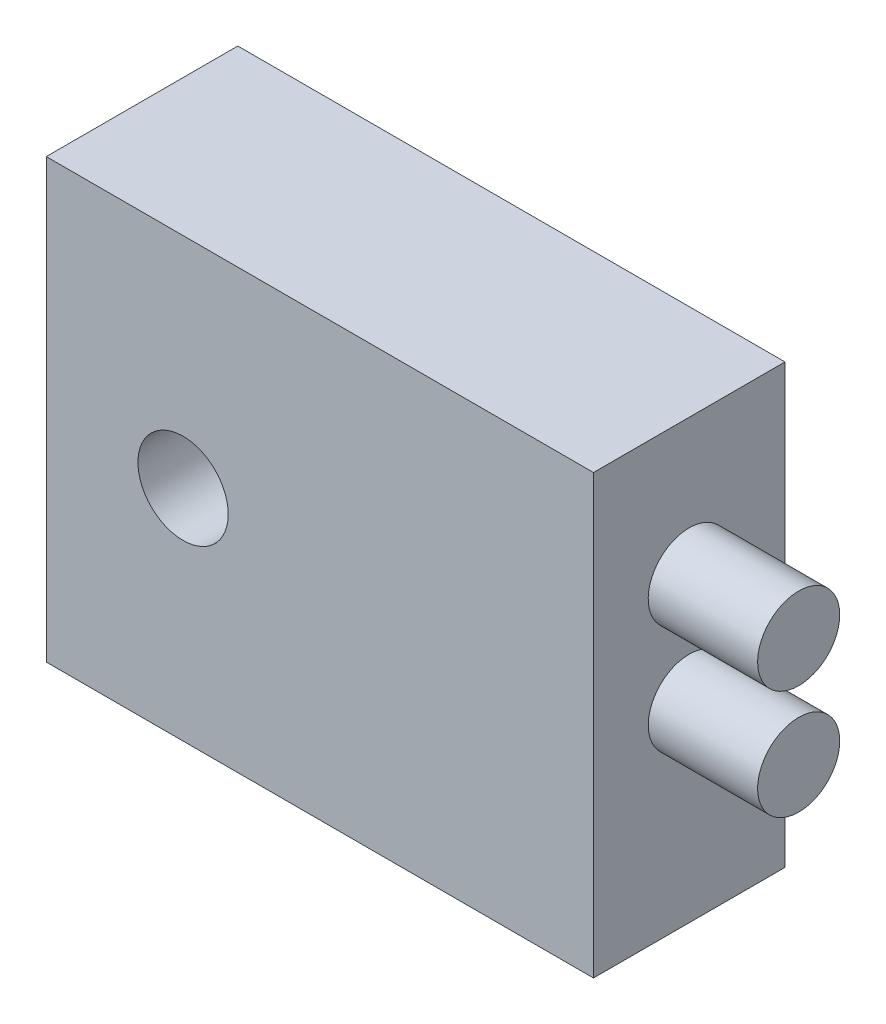
ISO-10303-21;
HEADER;
FILE_DESCRIPTION(('STEP AP214'),'2;1');
FILE_NAME('part.step','',(''),(''),'','','');
FILE_SCHEMA(('AUTOMOTIVE_DESIGN { 1 0 10303 214 1 1 1 1 }'));
ENDSEC;
DATA;
#1=APPLICATION_CONTEXT('core data for automotive mechanical design processes');
#2=APPLICATION_PROTOCOL_DEFINITION('international standard','automotive_design',2000,#1);
#3=PRODUCT_CONTEXT('',#1,'mechanical');
#4=PRODUCT('Part','Part','',(#3));
#5=PRODUCT_RELATED_PRODUCT_CATEGORY('part','',(#4));
#6=PRODUCT_DEFINITION_FORMATION('','',#4);
#7=PRODUCT_DEFINITION_CONTEXT('part definition',#1,'design');
#8=PRODUCT_DEFINITION('design','',#6,#7);
#9=PRODUCT_DEFINITION_SHAPE('','',#8);
#10=(LENGTH_UNIT() NAMED_UNIT(*) SI_UNIT(.MILLI.,.METRE.));
#11=(NAMED_UNIT(*) PLANE_ANGLE_UNIT() SI_UNIT($,.RADIAN.));
#12=(NAMED_UNIT(*) SI_UNIT($,.STERADIAN.) SOLID_ANGLE_UNIT());
#13=UNCERTAINTY_MEASURE_WITH_UNIT(LENGTH_MEASURE(1.E-05),#10,'distance_accuracy_value','');
#14=(GEOMETRIC_REPRESENTATION_CONTEXT(3) GLOBAL_UNCERTAINTY_ASSIGNED_CONTEXT((#13)) GLOBAL_UNIT_ASSIGNED_CONTEXT((#10,
#11,#12)) REPRESENTATION_CONTEXT('',''));
#15=CARTESIAN_POINT('',(0.,0.,0.));
#16=DIRECTION('',(0.,0.,1.));
#17=DIRECTION('',(1.,0.,0.));
#18=AXIS2_PLACEMENT_3D('',#15,#16,#17);
#19=CARTESIAN_POINT('',(0.,0.,7.));
#20=DIRECTION('',(0.,0.,-1.));
#21=DIRECTION('',(-1.,0.,0.));
#22=AXIS2_PLACEMENT_3D('',#19,#20,#21);
#23=PLANE('',#22);
#24=DIRECTION('',(0.,-1.,0.));
#25=VECTOR('',#24,1.);
#26=CARTESIAN_POINT('',(0.,0.,7.));
#27=LINE('',#26,#25);
#28=CARTESIAN_POINT('',(0.,16.,7.));
#29=VERTEX_POINT('',#28);
#30=CARTESIAN_POINT('',(0.,0.,7.));
#31=VERTEX_POINT('',#30);
#32=EDGE_CURVE('E90',#29,#31,#27,.T.);
#33=ORIENTED_EDGE('',*,*,#32,.T.);
#34=DIRECTION('',(1.,0.,0.));
#35=VECTOR('',#34,1.);
#36=CARTESIAN_POINT('',(0.,0.,7.));
#37=LINE('',#36,#35);
#38=CARTESIAN_POINT('',(20.,0.,7.));
#39=VERTEX_POINT('',#38);
#40=EDGE_CURVE('E85',#31,#39,#37,.T.);
#41=ORIENTED_EDGE('',*,*,#40,.T.);
#42=DIRECTION('',(0.,1.,0.));
#43=VECTOR('',#42,1.);
#44=CARTESIAN_POINT('',(20.,0.,7.));
#45=LINE('',#44,#43);
#46=CARTESIAN_POINT('',(20.,16.,7.));
#47=VERTEX_POINT('',#46);
#48=EDGE_CURVE('E88',#39,#47,#45,.T.);
#49=ORIENTED_EDGE('',*,*,#48,.T.);
#50=DIRECTION('',(-1.,0.,0.));
#51=VECTOR('',#50,1.);
#52=CARTESIAN_POINT('',(0.,16.,7.));
#53=LINE('',#52,#51);
#54=EDGE_CURVE('E54',#47,#29,#53,.T.);
#55=ORIENTED_EDGE('',*,*,#54,.T.);
#56=EDGE_LOOP('',(#33,#41,#49,#55));
#57=FACE_BOUND('',#56,.T.);
#58=CARTESIAN_POINT('',(5.,8.,7.));
#59=DIRECTION('',(0.,0.,1.));
#60=DIRECTION('',(1.,0.,0.));
#61=AXIS2_PLACEMENT_3D('',#58,#59,#60);
#62=CIRCLE('',#61,1.65);
#63=CARTESIAN_POINT('',(6.65,8.,7.));
#64=VERTEX_POINT('',#63);
#65=EDGE_CURVE('E113',#64,#64,#62,.T.);
#66=ORIENTED_EDGE('',*,*,#65,.F.);
#67=EDGE_LOOP('',(#66));
#68=FACE_BOUND('',#67,.T.);
#69=ADVANCED_FACE('F36',(#57,#68),#23,.F.);
#70=CARTESIAN_POINT('',(0.,0.,0.));
#71=DIRECTION('',(0.,0.,-1.));
#72=DIRECTION('',(-1.,0.,0.));
#73=AXIS2_PLACEMENT_3D('',#70,#71,#72);
#74=PLANE('',#73);
#75=DIRECTION('',(0.,-1.,0.));
#76=VECTOR('',#75,1.);
#77=CARTESIAN_POINT('',(0.,0.,0.));
#78=LINE('',#77,#76);
#79=CARTESIAN_POINT('',(0.,16.,0.));
#80=VERTEX_POINT('',#79);
#81=CARTESIAN_POINT('',(0.,0.,0.));
#82=VERTEX_POINT('',#81);
#83=EDGE_CURVE('E109',#80,#82,#78,.T.);
#84=ORIENTED_EDGE('',*,*,#83,.F.);
#85=DIRECTION('',(-1.,0.,0.));
#86=VECTOR('',#85,1.);
#87=CARTESIAN_POINT('',(0.,16.,0.));
#88=LINE('',#87,#86);
#89=CARTESIAN_POINT('',(20.,16.,0.));
#90=VERTEX_POINT('',#89);
#91=EDGE_CURVE('E77',#90,#80,#88,.T.);
#92=ORIENTED_EDGE('',*,*,#91,.F.);
#93=DIRECTION('',(0.,1.,0.));
#94=VECTOR('',#93,1.);
#95=CARTESIAN_POINT('',(20.,0.,0.));
#96=LINE('',#95,#94);
#97=CARTESIAN_POINT('',(20.,0.,0.));
#98=VERTEX_POINT('',#97);
#99=EDGE_CURVE('E71',#98,#90,#96,.T.);
#100=ORIENTED_EDGE('',*,*,#99,.F.);
#101=DIRECTION('',(1.,0.,0.));
#102=VECTOR('',#101,1.);
#103=CARTESIAN_POINT('',(0.,0.,0.));
#104=LINE('',#103,#102);
#105=EDGE_CURVE('E96',#82,#98,#104,.T.);
#106=ORIENTED_EDGE('',*,*,#105,.F.);
#107=EDGE_LOOP('',(#84,#92,#100,#106));
#108=FACE_BOUND('',#107,.T.);
#109=CARTESIAN_POINT('',(5.,8.,0.));
#110=DIRECTION('',(0.,0.,1.));
#111=DIRECTION('',(1.,0.,0.));
#112=AXIS2_PLACEMENT_3D('',#109,#110,#111);
#113=CIRCLE('',#112,1.65);
#114=CARTESIAN_POINT('',(6.65,8.,0.));
#115=VERTEX_POINT('',#114);
#116=EDGE_CURVE('E136',#115,#115,#113,.T.);
#117=ORIENTED_EDGE('',*,*,#116,.T.);
#118=EDGE_LOOP('',(#117));
#119=FACE_BOUND('',#118,.T.);
#120=ADVANCED_FACE('F171',(#108,#119),#74,.T.);
#121=CARTESIAN_POINT('',(0.,0.,7.));
#122=DIRECTION('',(1.,0.,0.));
#123=DIRECTION('',(0.,1.,0.));
#124=AXIS2_PLACEMENT_3D('',#121,#122,#123);
#125=PLANE('',#124);
#126=ORIENTED_EDGE('',*,*,#83,.T.);
#127=DIRECTION('',(0.,0.,-1.));
#128=VECTOR('',#127,1.);
#129=CARTESIAN_POINT('',(0.,0.,7.));
#130=LINE('',#129,#128);
#131=EDGE_CURVE('E98',#31,#82,#130,.T.);
#132=ORIENTED_EDGE('',*,*,#131,.F.);
#133=ORIENTED_EDGE('',*,*,#32,.F.);
#134=DIRECTION('',(0.,0.,-1.));
#135=VECTOR('',#134,1.);
#136=CARTESIAN_POINT('',(0.,16.,7.));
#137=LINE('',#136,#135);
#138=EDGE_CURVE('E105',#29,#80,#137,.T.);
#139=ORIENTED_EDGE('',*,*,#138,.T.);
#140=EDGE_LOOP('',(#126,#132,#133,#139));
#141=FACE_BOUND('',#140,.T.);
#142=ADVANCED_FACE('F38',(#141),#125,.F.);
#143=CARTESIAN_POINT('',(0.,0.,7.));
#144=DIRECTION('',(0.,1.,0.));
#145=DIRECTION('',(0.,0.,1.));
#146=AXIS2_PLACEMENT_3D('',#143,#144,#145);
#147=PLANE('',#146);
#148=ORIENTED_EDGE('',*,*,#105,.T.);
#149=DIRECTION('',(0.,0.,-1.));
#150=VECTOR('',#149,1.);
#151=CARTESIAN_POINT('',(20.,0.,7.));
#152=LINE('',#151,#150);
#153=EDGE_CURVE('E94',#39,#98,#152,.T.);
#154=ORIENTED_EDGE('',*,*,#153,.F.);
#155=ORIENTED_EDGE('',*,*,#40,.F.);
#156=ORIENTED_EDGE('',*,*,#131,.T.);
#157=EDGE_LOOP('',(#148,#154,#155,#156));
#158=FACE_BOUND('',#157,.T.);
#159=ADVANCED_FACE('F95',(#158),#147,.F.);
#160=CARTESIAN_POINT('',(20.,0.,7.));
#161=DIRECTION('',(-1.,0.,0.));
#162=DIRECTION('',(0.,-1.,0.));
#163=AXIS2_PLACEMENT_3D('',#160,#161,#162);
#164=PLANE('',#163);
#165=CARTESIAN_POINT('',(20.,11.,3.5));
#166=DIRECTION('',(-1.,0.,0.));
#167=DIRECTION('',(0.,-1.,0.));
#168=AXIS2_PLACEMENT_3D('',#165,#166,#167);
#169=CIRCLE('',#168,1.5);
#170=CARTESIAN_POINT('',(20.,9.5,3.5));
#171=VERTEX_POINT('',#170);
#172=EDGE_CURVE('E11',#171,#171,#169,.F.);
#173=ORIENTED_EDGE('',*,*,#172,.F.);
#174=EDGE_LOOP('',(#173));
#175=FACE_BOUND('',#174,.T.);
#176=CARTESIAN_POINT('',(20.,7.00000000000001,3.5));
#177=DIRECTION('',(1.,0.,0.));
#178=DIRECTION('',(0.,0.,-1.));
#179=AXIS2_PLACEMENT_3D('',#176,#177,#178);
#180=CIRCLE('',#179,1.5);
#181=CARTESIAN_POINT('',(20.,7.00000000000001,2.));
#182=VERTEX_POINT('',#181);
#183=EDGE_CURVE('E46',#182,#182,#180,.T.);
#184=ORIENTED_EDGE('',*,*,#183,.F.);
#185=EDGE_LOOP('',(#184));
#186=FACE_BOUND('',#185,.T.);
#187=ORIENTED_EDGE('',*,*,#99,.T.);
#188=DIRECTION('',(0.,0.,-1.));
#189=VECTOR('',#188,1.);
#190=CARTESIAN_POINT('',(20.,16.,7.));
#191=LINE('',#190,#189);
#192=EDGE_CURVE('E99',#47,#90,#191,.T.);
#193=ORIENTED_EDGE('',*,*,#192,.F.);
#194=ORIENTED_EDGE('',*,*,#48,.F.);
#195=ORIENTED_EDGE('',*,*,#153,.T.);
#196=EDGE_LOOP('',(#187,#193,#194,#195));
#197=FACE_BOUND('',#196,.T.);
#198=ADVANCED_FACE('F101',(#175,#186,#197),#164,.F.);
#199=CARTESIAN_POINT('',(0.,16.,7.));
#200=DIRECTION('',(0.,-1.,0.));
#201=DIRECTION('',(0.,0.,-1.));
#202=AXIS2_PLACEMENT_3D('',#199,#200,#201);
#203=PLANE('',#202);
#204=ORIENTED_EDGE('',*,*,#91,.T.);
#205=ORIENTED_EDGE('',*,*,#138,.F.);
#206=ORIENTED_EDGE('',*,*,#54,.F.);
#207=ORIENTED_EDGE('',*,*,#192,.T.);
#208=EDGE_LOOP('',(#204,#205,#206,#207));
#209=FACE_BOUND('',#208,.T.);
#210=ADVANCED_FACE('F162',(#209),#203,.F.);
#211=CARTESIAN_POINT('',(5.,8.,7.));
#212=DIRECTION('',(0.,0.,-1.));
#213=DIRECTION('',(-1.,0.,0.));
#214=AXIS2_PLACEMENT_3D('',#211,#212,#213);
#215=CYLINDRICAL_SURFACE('',#214,1.65);
#216=ORIENTED_EDGE('',*,*,#65,.T.);
#217=EDGE_LOOP('',(#216));
#218=FACE_BOUND('',#217,.T.);
#219=ORIENTED_EDGE('',*,*,#116,.F.);
#220=EDGE_LOOP('',(#219));
#221=FACE_BOUND('',#220,.T.);
#222=ADVANCED_FACE('F168',(#218,#221),#215,.F.);
#223=CARTESIAN_POINT('',(24.,7.00000000000001,3.5));
#224=DIRECTION('',(-1.,0.,0.));
#225=DIRECTION('',(0.,0.,1.));
#226=AXIS2_PLACEMENT_3D('',#223,#224,#225);
#227=CYLINDRICAL_SURFACE('',#226,1.5);
#228=CARTESIAN_POINT('',(24.,7.00000000000001,3.5));
#229=DIRECTION('',(1.,0.,0.));
#230=DIRECTION('',(0.,0.,-1.));
#231=AXIS2_PLACEMENT_3D('',#228,#229,#230);
#232=CIRCLE('',#231,1.5);
#233=CARTESIAN_POINT('',(24.,7.00000000000001,2.));
#234=VERTEX_POINT('',#233);
#235=EDGE_CURVE('E131',#234,#234,#232,.T.);
#236=ORIENTED_EDGE('',*,*,#235,.F.);
#237=EDGE_LOOP('',(#236));
#238=FACE_BOUND('',#237,.T.);
#239=ORIENTED_EDGE('',*,*,#183,.T.);
#240=EDGE_LOOP('',(#239));
#241=FACE_BOUND('',#240,.T.);
#242=ADVANCED_FACE('F181',(#238,#241),#227,.T.);
#243=CARTESIAN_POINT('',(24.,7.00000000000001,3.5));
#244=DIRECTION('',(1.,0.,0.));
#245=DIRECTION('',(0.,0.,-1.));
#246=AXIS2_PLACEMENT_3D('',#243,#244,#245);
#247=PLANE('',#246);
#248=ORIENTED_EDGE('',*,*,#235,.T.);
#249=EDGE_LOOP('',(#248));
#250=FACE_BOUND('',#249,.T.);
#251=ADVANCED_FACE('F156',(#250),#247,.T.);
#252=CARTESIAN_POINT('',(24.,11.,3.5));
#253=DIRECTION('',(-1.,0.,0.));
#254=DIRECTION('',(0.,0.,1.));
#255=AXIS2_PLACEMENT_3D('',#252,#253,#254);
#256=CYLINDRICAL_SURFACE('',#255,1.5);
#257=CARTESIAN_POINT('',(24.,11.,3.5));
#258=DIRECTION('',(1.,0.,0.));
#259=DIRECTION('',(0.,0.,-1.));
#260=AXIS2_PLACEMENT_3D('',#257,#258,#259);
#261=CIRCLE('',#260,1.5);
#262=CARTESIAN_POINT('',(24.,11.,2.));
#263=VERTEX_POINT('',#262);
#264=EDGE_CURVE('E144',#263,#263,#261,.T.);
#265=ORIENTED_EDGE('',*,*,#264,.F.);
#266=EDGE_LOOP('',(#265));
#267=FACE_BOUND('',#266,.T.);
#268=ORIENTED_EDGE('',*,*,#172,.T.);
#269=EDGE_LOOP('',(#268));
#270=FACE_BOUND('',#269,.T.);
#271=ADVANCED_FACE('F153',(#267,#270),#256,.T.);
#272=CARTESIAN_POINT('',(24.,11.,3.5));
#273=DIRECTION('',(1.,0.,0.));
#274=DIRECTION('',(0.,0.,-1.));
#275=AXIS2_PLACEMENT_3D('',#272,#273,#274);
#276=PLANE('',#275);
#277=ORIENTED_EDGE('',*,*,#264,.T.);
#278=EDGE_LOOP('',(#277));
#279=FACE_BOUND('',#278,.T.);
#280=ADVANCED_FACE('F151',(#279),#276,.T.);
#281=CLOSED_SHELL('',(#69,#120,#142,#159,#198,#210,#222,#242,#251,#271,#280));
#282=MANIFOLD_SOLID_BREP('B2',#281);
#283=ADVANCED_BREP_SHAPE_REPRESENTATION('',(#18,#282),#14);
#284=SHAPE_DEFINITION_REPRESENTATION(#9,#283);
ENDSEC;
END-ISO-10303-21;
